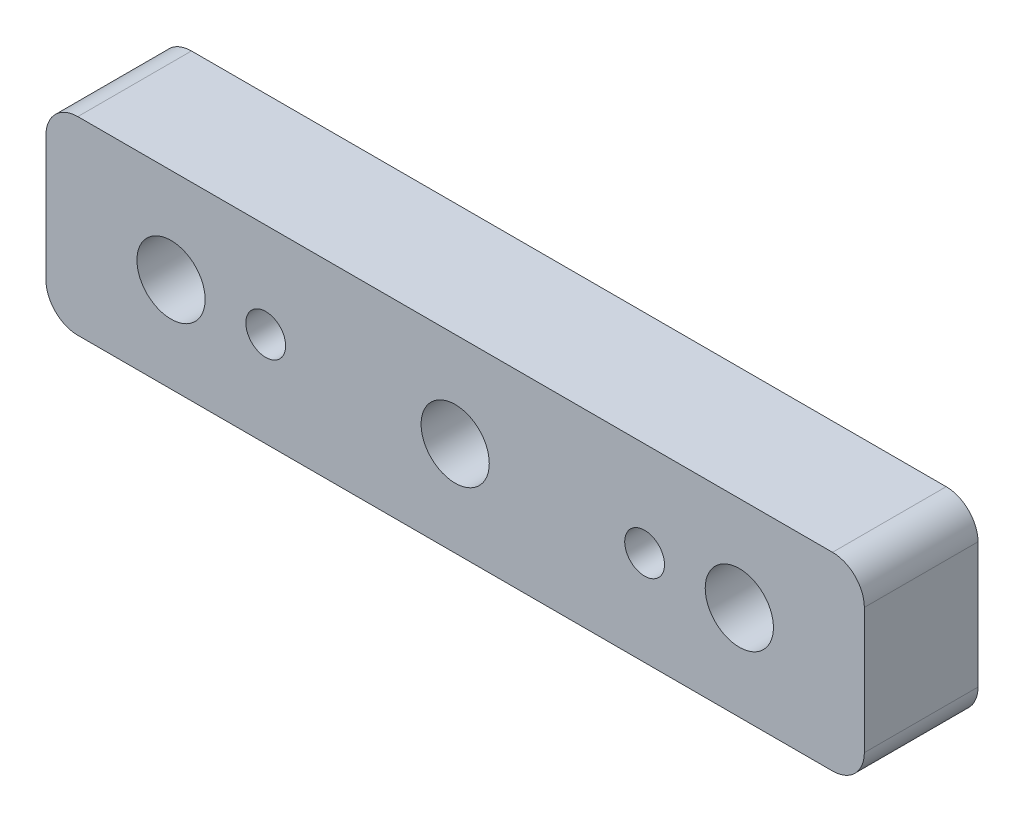
ISO-10303-21;
HEADER;
FILE_DESCRIPTION(('STEP AP214'),'2;1');
FILE_NAME('part.step','',(''),(''),'','','');
FILE_SCHEMA(('AUTOMOTIVE_DESIGN { 1 0 10303 214 1 1 1 1 }'));
ENDSEC;
DATA;
#1=APPLICATION_CONTEXT('core data for automotive mechanical design processes');
#2=APPLICATION_PROTOCOL_DEFINITION('international standard','automotive_design',2000,#1);
#3=PRODUCT_CONTEXT('',#1,'mechanical');
#4=PRODUCT('Part','Part','',(#3));
#5=PRODUCT_RELATED_PRODUCT_CATEGORY('part','',(#4));
#6=PRODUCT_DEFINITION_FORMATION('','',#4);
#7=PRODUCT_DEFINITION_CONTEXT('part definition',#1,'design');
#8=PRODUCT_DEFINITION('design','',#6,#7);
#9=PRODUCT_DEFINITION_SHAPE('','',#8);
#10=(LENGTH_UNIT() NAMED_UNIT(*) SI_UNIT(.MILLI.,.METRE.));
#11=(NAMED_UNIT(*) PLANE_ANGLE_UNIT() SI_UNIT($,.RADIAN.));
#12=(NAMED_UNIT(*) SI_UNIT($,.STERADIAN.) SOLID_ANGLE_UNIT());
#13=UNCERTAINTY_MEASURE_WITH_UNIT(LENGTH_MEASURE(1.E-05),#10,'distance_accuracy_value','');
#14=(GEOMETRIC_REPRESENTATION_CONTEXT(3) GLOBAL_UNCERTAINTY_ASSIGNED_CONTEXT((#13)) GLOBAL_UNIT_ASSIGNED_CONTEXT((#10,
#11,#12)) REPRESENTATION_CONTEXT('',''));
#15=CARTESIAN_POINT('',(0.,0.,0.));
#16=DIRECTION('',(0.,0.,1.));
#17=DIRECTION('',(1.,0.,0.));
#18=AXIS2_PLACEMENT_3D('',#15,#16,#17);
#19=CARTESIAN_POINT('',(39.84,6.64000000000001,12.));
#20=DIRECTION('',(0.,0.,-1.));
#21=DIRECTION('',(-1.,0.,0.));
#22=AXIS2_PLACEMENT_3D('',#19,#20,#21);
#23=CYLINDRICAL_SURFACE('',#22,3.36);
#24=CARTESIAN_POINT('',(39.84,6.64000000000001,0.));
#25=DIRECTION('',(0.,0.,1.));
#26=DIRECTION('',(1.,0.,0.));
#27=AXIS2_PLACEMENT_3D('',#24,#25,#26);
#28=CIRCLE('',#27,3.36);
#29=CARTESIAN_POINT('',(43.2,6.64000000000001,0.));
#30=VERTEX_POINT('',#29);
#31=CARTESIAN_POINT('',(39.84,10.,0.));
#32=VERTEX_POINT('',#31);
#33=EDGE_CURVE('E130',#30,#32,#28,.T.);
#34=ORIENTED_EDGE('',*,*,#33,.T.);
#35=DIRECTION('',(0.,0.,-1.));
#36=VECTOR('',#35,1.);
#37=CARTESIAN_POINT('',(39.84,10.,12.));
#38=LINE('',#37,#36);
#39=CARTESIAN_POINT('',(39.84,10.,12.));
#40=VERTEX_POINT('',#39);
#41=EDGE_CURVE('E11',#40,#32,#38,.T.);
#42=ORIENTED_EDGE('',*,*,#41,.F.);
#43=CARTESIAN_POINT('',(39.84,6.64000000000001,12.));
#44=DIRECTION('',(0.,0.,1.));
#45=DIRECTION('',(1.,0.,0.));
#46=AXIS2_PLACEMENT_3D('',#43,#44,#45);
#47=CIRCLE('',#46,3.36);
#48=CARTESIAN_POINT('',(43.2,6.64000000000001,12.));
#49=VERTEX_POINT('',#48);
#50=EDGE_CURVE('E145',#49,#40,#47,.T.);
#51=ORIENTED_EDGE('',*,*,#50,.F.);
#52=DIRECTION('',(0.,0.,-1.));
#53=VECTOR('',#52,1.);
#54=CARTESIAN_POINT('',(43.2,6.64000000000001,12.));
#55=LINE('',#54,#53);
#56=EDGE_CURVE('E126',#49,#30,#55,.T.);
#57=ORIENTED_EDGE('',*,*,#56,.T.);
#58=EDGE_LOOP('',(#34,#42,#51,#57));
#59=FACE_BOUND('',#58,.T.);
#60=ADVANCED_FACE('F34',(#59),#23,.T.);
#61=CARTESIAN_POINT('',(39.84,10.,12.));
#62=DIRECTION('',(0.,-1.,0.));
#63=DIRECTION('',(1.,0.,0.));
#64=AXIS2_PLACEMENT_3D('',#61,#62,#63);
#65=PLANE('',#64);
#66=DIRECTION('',(-1.,0.,0.));
#67=VECTOR('',#66,1.);
#68=CARTESIAN_POINT('',(39.84,10.,0.));
#69=LINE('',#68,#67);
#70=CARTESIAN_POINT('',(-39.84,9.99999999999999,0.));
#71=VERTEX_POINT('',#70);
#72=EDGE_CURVE('E133',#32,#71,#69,.T.);
#73=ORIENTED_EDGE('',*,*,#72,.T.);
#74=DIRECTION('',(0.,0.,-1.));
#75=VECTOR('',#74,1.);
#76=CARTESIAN_POINT('',(-39.84,9.99999999999999,12.));
#77=LINE('',#76,#75);
#78=CARTESIAN_POINT('',(-39.84,9.99999999999999,12.));
#79=VERTEX_POINT('',#78);
#80=EDGE_CURVE('E42',#79,#71,#77,.T.);
#81=ORIENTED_EDGE('',*,*,#80,.F.);
#82=DIRECTION('',(-1.,0.,0.));
#83=VECTOR('',#82,1.);
#84=CARTESIAN_POINT('',(39.84,10.,12.));
#85=LINE('',#84,#83);
#86=EDGE_CURVE('E93',#40,#79,#85,.T.);
#87=ORIENTED_EDGE('',*,*,#86,.F.);
#88=ORIENTED_EDGE('',*,*,#41,.T.);
#89=EDGE_LOOP('',(#73,#81,#87,#88));
#90=FACE_BOUND('',#89,.T.);
#91=ADVANCED_FACE('F238',(#90),#65,.F.);
#92=CARTESIAN_POINT('',(-39.84,6.64,12.));
#93=DIRECTION('',(0.,0.,-1.));
#94=DIRECTION('',(-1.,0.,0.));
#95=AXIS2_PLACEMENT_3D('',#92,#93,#94);
#96=CYLINDRICAL_SURFACE('',#95,3.36);
#97=CARTESIAN_POINT('',(-39.84,6.64,0.));
#98=DIRECTION('',(0.,0.,1.));
#99=DIRECTION('',(1.,0.,0.));
#100=AXIS2_PLACEMENT_3D('',#97,#98,#99);
#101=CIRCLE('',#100,3.36);
#102=CARTESIAN_POINT('',(-43.2,6.64,0.));
#103=VERTEX_POINT('',#102);
#104=EDGE_CURVE('E136',#71,#103,#101,.T.);
#105=ORIENTED_EDGE('',*,*,#104,.T.);
#106=DIRECTION('',(0.,0.,-1.));
#107=VECTOR('',#106,1.);
#108=CARTESIAN_POINT('',(-43.2,6.64,12.));
#109=LINE('',#108,#107);
#110=CARTESIAN_POINT('',(-43.2,6.64,12.));
#111=VERTEX_POINT('',#110);
#112=EDGE_CURVE('E152',#111,#103,#109,.T.);
#113=ORIENTED_EDGE('',*,*,#112,.F.);
#114=CARTESIAN_POINT('',(-39.84,6.64,12.));
#115=DIRECTION('',(0.,0.,1.));
#116=DIRECTION('',(1.,0.,0.));
#117=AXIS2_PLACEMENT_3D('',#114,#115,#116);
#118=CIRCLE('',#117,3.36);
#119=EDGE_CURVE('E160',#79,#111,#118,.T.);
#120=ORIENTED_EDGE('',*,*,#119,.F.);
#121=ORIENTED_EDGE('',*,*,#80,.T.);
#122=EDGE_LOOP('',(#105,#113,#120,#121));
#123=FACE_BOUND('',#122,.T.);
#124=ADVANCED_FACE('F158',(#123),#96,.T.);
#125=CARTESIAN_POINT('',(-43.2,-6.64,12.));
#126=DIRECTION('',(1.,0.,0.));
#127=DIRECTION('',(0.,0.,-1.));
#128=AXIS2_PLACEMENT_3D('',#125,#126,#127);
#129=PLANE('',#128);
#130=DIRECTION('',(0.,-1.,0.));
#131=VECTOR('',#130,1.);
#132=CARTESIAN_POINT('',(-43.2,-6.64,0.));
#133=LINE('',#132,#131);
#134=CARTESIAN_POINT('',(-43.2,-6.64,0.));
#135=VERTEX_POINT('',#134);
#136=EDGE_CURVE('E138',#103,#135,#133,.T.);
#137=ORIENTED_EDGE('',*,*,#136,.T.);
#138=DIRECTION('',(0.,0.,-1.));
#139=VECTOR('',#138,1.);
#140=CARTESIAN_POINT('',(-43.2,-6.64,12.));
#141=LINE('',#140,#139);
#142=CARTESIAN_POINT('',(-43.2,-6.64,12.));
#143=VERTEX_POINT('',#142);
#144=EDGE_CURVE('E149',#143,#135,#141,.T.);
#145=ORIENTED_EDGE('',*,*,#144,.F.);
#146=DIRECTION('',(0.,-1.,0.));
#147=VECTOR('',#146,1.);
#148=CARTESIAN_POINT('',(-43.2,-6.64,12.));
#149=LINE('',#148,#147);
#150=EDGE_CURVE('E172',#111,#143,#149,.T.);
#151=ORIENTED_EDGE('',*,*,#150,.F.);
#152=ORIENTED_EDGE('',*,*,#112,.T.);
#153=EDGE_LOOP('',(#137,#145,#151,#152));
#154=FACE_BOUND('',#153,.T.);
#155=ADVANCED_FACE('F168',(#154),#129,.F.);
#156=CARTESIAN_POINT('',(-39.84,-6.64,12.));
#157=DIRECTION('',(0.,0.,-1.));
#158=DIRECTION('',(-1.,0.,0.));
#159=AXIS2_PLACEMENT_3D('',#156,#157,#158);
#160=CYLINDRICAL_SURFACE('',#159,3.36);
#161=CARTESIAN_POINT('',(-39.84,-6.64,0.));
#162=DIRECTION('',(0.,0.,1.));
#163=DIRECTION('',(-1.,0.,0.));
#164=AXIS2_PLACEMENT_3D('',#161,#162,#163);
#165=CIRCLE('',#164,3.36);
#166=CARTESIAN_POINT('',(-39.84,-10.,0.));
#167=VERTEX_POINT('',#166);
#168=EDGE_CURVE('E140',#135,#167,#165,.T.);
#169=ORIENTED_EDGE('',*,*,#168,.T.);
#170=DIRECTION('',(0.,0.,-1.));
#171=VECTOR('',#170,1.);
#172=CARTESIAN_POINT('',(-39.84,-10.,12.));
#173=LINE('',#172,#171);
#174=CARTESIAN_POINT('',(-39.84,-10.,12.));
#175=VERTEX_POINT('',#174);
#176=EDGE_CURVE('E121',#175,#167,#173,.T.);
#177=ORIENTED_EDGE('',*,*,#176,.F.);
#178=CARTESIAN_POINT('',(-39.84,-6.64,12.));
#179=DIRECTION('',(0.,0.,1.));
#180=DIRECTION('',(-1.,0.,0.));
#181=AXIS2_PLACEMENT_3D('',#178,#179,#180);
#182=CIRCLE('',#181,3.36);
#183=EDGE_CURVE('E112',#143,#175,#182,.T.);
#184=ORIENTED_EDGE('',*,*,#183,.F.);
#185=ORIENTED_EDGE('',*,*,#144,.T.);
#186=EDGE_LOOP('',(#169,#177,#184,#185));
#187=FACE_BOUND('',#186,.T.);
#188=ADVANCED_FACE('F171',(#187),#160,.T.);
#189=CARTESIAN_POINT('',(39.84,-9.99999999999999,12.));
#190=DIRECTION('',(0.,1.,0.));
#191=DIRECTION('',(-1.,0.,0.));
#192=AXIS2_PLACEMENT_3D('',#189,#190,#191);
#193=PLANE('',#192);
#194=DIRECTION('',(1.,0.,0.));
#195=VECTOR('',#194,1.);
#196=CARTESIAN_POINT('',(39.84,-9.99999999999999,0.));
#197=LINE('',#196,#195);
#198=CARTESIAN_POINT('',(39.84,-9.99999999999999,0.));
#199=VERTEX_POINT('',#198);
#200=EDGE_CURVE('E120',#167,#199,#197,.T.);
#201=ORIENTED_EDGE('',*,*,#200,.T.);
#202=DIRECTION('',(0.,0.,-1.));
#203=VECTOR('',#202,1.);
#204=CARTESIAN_POINT('',(39.84,-9.99999999999999,12.));
#205=LINE('',#204,#203);
#206=CARTESIAN_POINT('',(39.84,-9.99999999999999,12.));
#207=VERTEX_POINT('',#206);
#208=EDGE_CURVE('E117',#207,#199,#205,.T.);
#209=ORIENTED_EDGE('',*,*,#208,.F.);
#210=DIRECTION('',(1.,0.,0.));
#211=VECTOR('',#210,1.);
#212=CARTESIAN_POINT('',(39.84,-9.99999999999999,12.));
#213=LINE('',#212,#211);
#214=EDGE_CURVE('E106',#175,#207,#213,.T.);
#215=ORIENTED_EDGE('',*,*,#214,.F.);
#216=ORIENTED_EDGE('',*,*,#176,.T.);
#217=EDGE_LOOP('',(#201,#209,#215,#216));
#218=FACE_BOUND('',#217,.T.);
#219=ADVANCED_FACE('F118',(#218),#193,.F.);
#220=CARTESIAN_POINT('',(39.84,-6.64,12.));
#221=DIRECTION('',(0.,0.,-1.));
#222=DIRECTION('',(-1.,0.,0.));
#223=AXIS2_PLACEMENT_3D('',#220,#221,#222);
#224=CYLINDRICAL_SURFACE('',#223,3.36);
#225=CARTESIAN_POINT('',(39.84,-6.64,0.));
#226=DIRECTION('',(0.,0.,1.));
#227=DIRECTION('',(1.,0.,0.));
#228=AXIS2_PLACEMENT_3D('',#225,#226,#227);
#229=CIRCLE('',#228,3.36);
#230=CARTESIAN_POINT('',(43.2,-6.64,0.));
#231=VERTEX_POINT('',#230);
#232=EDGE_CURVE('E79',#199,#231,#229,.T.);
#233=ORIENTED_EDGE('',*,*,#232,.T.);
#234=DIRECTION('',(0.,0.,-1.));
#235=VECTOR('',#234,1.);
#236=CARTESIAN_POINT('',(43.2,-6.64,12.));
#237=LINE('',#236,#235);
#238=CARTESIAN_POINT('',(43.2,-6.64,12.));
#239=VERTEX_POINT('',#238);
#240=EDGE_CURVE('E122',#239,#231,#237,.T.);
#241=ORIENTED_EDGE('',*,*,#240,.F.);
#242=CARTESIAN_POINT('',(39.84,-6.64,12.));
#243=DIRECTION('',(0.,0.,1.));
#244=DIRECTION('',(1.,0.,0.));
#245=AXIS2_PLACEMENT_3D('',#242,#243,#244);
#246=CIRCLE('',#245,3.36);
#247=EDGE_CURVE('E110',#207,#239,#246,.T.);
#248=ORIENTED_EDGE('',*,*,#247,.F.);
#249=ORIENTED_EDGE('',*,*,#208,.T.);
#250=EDGE_LOOP('',(#233,#241,#248,#249));
#251=FACE_BOUND('',#250,.T.);
#252=ADVANCED_FACE('F124',(#251),#224,.T.);
#253=CARTESIAN_POINT('',(43.2,-6.64,12.));
#254=DIRECTION('',(-1.,0.,0.));
#255=DIRECTION('',(0.,0.,1.));
#256=AXIS2_PLACEMENT_3D('',#253,#254,#255);
#257=PLANE('',#256);
#258=DIRECTION('',(0.,1.,0.));
#259=VECTOR('',#258,1.);
#260=CARTESIAN_POINT('',(43.2,-6.64,0.));
#261=LINE('',#260,#259);
#262=EDGE_CURVE('E85',#231,#30,#261,.T.);
#263=ORIENTED_EDGE('',*,*,#262,.T.);
#264=ORIENTED_EDGE('',*,*,#56,.F.);
#265=DIRECTION('',(0.,1.,0.));
#266=VECTOR('',#265,1.);
#267=CARTESIAN_POINT('',(43.2,-6.64,12.));
#268=LINE('',#267,#266);
#269=EDGE_CURVE('E50',#239,#49,#268,.T.);
#270=ORIENTED_EDGE('',*,*,#269,.F.);
#271=ORIENTED_EDGE('',*,*,#240,.T.);
#272=EDGE_LOOP('',(#263,#264,#270,#271));
#273=FACE_BOUND('',#272,.T.);
#274=ADVANCED_FACE('F212',(#273),#257,.F.);
#275=CARTESIAN_POINT('',(39.84,6.64000000000001,12.));
#276=DIRECTION('',(0.,0.,1.));
#277=DIRECTION('',(1.,0.,0.));
#278=AXIS2_PLACEMENT_3D('',#275,#276,#277);
#279=PLANE('',#278);
#280=CARTESIAN_POINT('',(-20.,0.,12.));
#281=DIRECTION('',(0.,0.,1.));
#282=DIRECTION('',(1.,0.,0.));
#283=AXIS2_PLACEMENT_3D('',#280,#281,#282);
#284=CIRCLE('',#283,2.09999999999999);
#285=CARTESIAN_POINT('',(-17.9,0.,12.));
#286=VERTEX_POINT('',#285);
#287=EDGE_CURVE('E204',#286,#286,#284,.T.);
#288=ORIENTED_EDGE('',*,*,#287,.F.);
#289=EDGE_LOOP('',(#288));
#290=FACE_BOUND('',#289,.T.);
#291=CARTESIAN_POINT('',(20.,0.,12.));
#292=DIRECTION('',(0.,0.,1.));
#293=DIRECTION('',(1.,0.,0.));
#294=AXIS2_PLACEMENT_3D('',#291,#292,#293);
#295=CIRCLE('',#294,2.09999999999999);
#296=CARTESIAN_POINT('',(22.1,0.,12.));
#297=VERTEX_POINT('',#296);
#298=EDGE_CURVE('E198',#297,#297,#295,.T.);
#299=ORIENTED_EDGE('',*,*,#298,.F.);
#300=EDGE_LOOP('',(#299));
#301=FACE_BOUND('',#300,.T.);
#302=CARTESIAN_POINT('',(30.,0.,12.));
#303=DIRECTION('',(0.,0.,1.));
#304=DIRECTION('',(-1.,0.,0.));
#305=AXIS2_PLACEMENT_3D('',#302,#303,#304);
#306=CIRCLE('',#305,3.6);
#307=CARTESIAN_POINT('',(26.4,0.,12.));
#308=VERTEX_POINT('',#307);
#309=EDGE_CURVE('E190',#308,#308,#306,.T.);
#310=ORIENTED_EDGE('',*,*,#309,.F.);
#311=EDGE_LOOP('',(#310));
#312=FACE_BOUND('',#311,.T.);
#313=CARTESIAN_POINT('',(-30.,0.,12.));
#314=DIRECTION('',(0.,0.,1.));
#315=DIRECTION('',(1.,0.,0.));
#316=AXIS2_PLACEMENT_3D('',#313,#314,#315);
#317=CIRCLE('',#316,3.6);
#318=CARTESIAN_POINT('',(-26.4,0.,12.));
#319=VERTEX_POINT('',#318);
#320=EDGE_CURVE('E184',#319,#319,#317,.T.);
#321=ORIENTED_EDGE('',*,*,#320,.F.);
#322=EDGE_LOOP('',(#321));
#323=FACE_BOUND('',#322,.T.);
#324=CARTESIAN_POINT('',(0.,0.,12.));
#325=DIRECTION('',(0.,0.,1.));
#326=DIRECTION('',(1.,0.,0.));
#327=AXIS2_PLACEMENT_3D('',#324,#325,#326);
#328=CIRCLE('',#327,3.6);
#329=CARTESIAN_POINT('',(3.6,0.,12.));
#330=VERTEX_POINT('',#329);
#331=EDGE_CURVE('E178',#330,#330,#328,.T.);
#332=ORIENTED_EDGE('',*,*,#331,.F.);
#333=EDGE_LOOP('',(#332));
#334=FACE_BOUND('',#333,.T.);
#335=ORIENTED_EDGE('',*,*,#50,.T.);
#336=ORIENTED_EDGE('',*,*,#86,.T.);
#337=ORIENTED_EDGE('',*,*,#119,.T.);
#338=ORIENTED_EDGE('',*,*,#150,.T.);
#339=ORIENTED_EDGE('',*,*,#183,.T.);
#340=ORIENTED_EDGE('',*,*,#214,.T.);
#341=ORIENTED_EDGE('',*,*,#247,.T.);
#342=ORIENTED_EDGE('',*,*,#269,.T.);
#343=EDGE_LOOP('',(#335,#336,#337,#338,#339,#340,#341,#342));
#344=FACE_BOUND('',#343,.T.);
#345=ADVANCED_FACE('F108',(#290,#301,#312,#323,#334,#344),#279,.T.);
#346=CARTESIAN_POINT('',(39.84,6.64000000000001,0.));
#347=DIRECTION('',(0.,0.,1.));
#348=DIRECTION('',(1.,0.,0.));
#349=AXIS2_PLACEMENT_3D('',#346,#347,#348);
#350=PLANE('',#349);
#351=CARTESIAN_POINT('',(-20.,0.,0.));
#352=DIRECTION('',(0.,0.,1.));
#353=DIRECTION('',(1.,0.,0.));
#354=AXIS2_PLACEMENT_3D('',#351,#352,#353);
#355=CIRCLE('',#354,2.1);
#356=CARTESIAN_POINT('',(-17.9,0.,0.));
#357=VERTEX_POINT('',#356);
#358=EDGE_CURVE('E201',#357,#357,#355,.T.);
#359=ORIENTED_EDGE('',*,*,#358,.T.);
#360=EDGE_LOOP('',(#359));
#361=FACE_BOUND('',#360,.T.);
#362=CARTESIAN_POINT('',(20.,0.,0.));
#363=DIRECTION('',(0.,0.,1.));
#364=DIRECTION('',(1.,0.,0.));
#365=AXIS2_PLACEMENT_3D('',#362,#363,#364);
#366=CIRCLE('',#365,2.1);
#367=CARTESIAN_POINT('',(22.1,0.,0.));
#368=VERTEX_POINT('',#367);
#369=EDGE_CURVE('E193',#368,#368,#366,.T.);
#370=ORIENTED_EDGE('',*,*,#369,.T.);
#371=EDGE_LOOP('',(#370));
#372=FACE_BOUND('',#371,.T.);
#373=CARTESIAN_POINT('',(30.,0.,0.));
#374=DIRECTION('',(0.,0.,1.));
#375=DIRECTION('',(-1.,0.,0.));
#376=AXIS2_PLACEMENT_3D('',#373,#374,#375);
#377=CIRCLE('',#376,3.6);
#378=CARTESIAN_POINT('',(26.4,0.,0.));
#379=VERTEX_POINT('',#378);
#380=EDGE_CURVE('E187',#379,#379,#377,.T.);
#381=ORIENTED_EDGE('',*,*,#380,.T.);
#382=EDGE_LOOP('',(#381));
#383=FACE_BOUND('',#382,.T.);
#384=CARTESIAN_POINT('',(-30.,0.,0.));
#385=DIRECTION('',(0.,0.,1.));
#386=DIRECTION('',(1.,0.,0.));
#387=AXIS2_PLACEMENT_3D('',#384,#385,#386);
#388=CIRCLE('',#387,3.6);
#389=CARTESIAN_POINT('',(-26.4,0.,0.));
#390=VERTEX_POINT('',#389);
#391=EDGE_CURVE('E181',#390,#390,#388,.T.);
#392=ORIENTED_EDGE('',*,*,#391,.T.);
#393=EDGE_LOOP('',(#392));
#394=FACE_BOUND('',#393,.T.);
#395=CARTESIAN_POINT('',(0.,0.,0.));
#396=DIRECTION('',(0.,0.,1.));
#397=DIRECTION('',(1.,0.,0.));
#398=AXIS2_PLACEMENT_3D('',#395,#396,#397);
#399=CIRCLE('',#398,3.6);
#400=CARTESIAN_POINT('',(3.6,0.,0.));
#401=VERTEX_POINT('',#400);
#402=EDGE_CURVE('E134',#401,#401,#399,.T.);
#403=ORIENTED_EDGE('',*,*,#402,.T.);
#404=EDGE_LOOP('',(#403));
#405=FACE_BOUND('',#404,.T.);
#406=ORIENTED_EDGE('',*,*,#33,.F.);
#407=ORIENTED_EDGE('',*,*,#262,.F.);
#408=ORIENTED_EDGE('',*,*,#232,.F.);
#409=ORIENTED_EDGE('',*,*,#200,.F.);
#410=ORIENTED_EDGE('',*,*,#168,.F.);
#411=ORIENTED_EDGE('',*,*,#136,.F.);
#412=ORIENTED_EDGE('',*,*,#104,.F.);
#413=ORIENTED_EDGE('',*,*,#72,.F.);
#414=EDGE_LOOP('',(#406,#407,#408,#409,#410,#411,#412,#413));
#415=FACE_BOUND('',#414,.T.);
#416=ADVANCED_FACE('F164',(#361,#372,#383,#394,#405,#415),#350,.F.);
#417=CARTESIAN_POINT('',(0.,0.,0.));
#418=DIRECTION('',(0.,0.,1.));
#419=DIRECTION('',(1.,0.,0.));
#420=AXIS2_PLACEMENT_3D('',#417,#418,#419);
#421=CYLINDRICAL_SURFACE('',#420,3.6);
#422=ORIENTED_EDGE('',*,*,#402,.F.);
#423=EDGE_LOOP('',(#422));
#424=FACE_BOUND('',#423,.T.);
#425=ORIENTED_EDGE('',*,*,#331,.T.);
#426=EDGE_LOOP('',(#425));
#427=FACE_BOUND('',#426,.T.);
#428=ADVANCED_FACE('F222',(#424,#427),#421,.F.);
#429=CARTESIAN_POINT('',(-30.,0.,0.));
#430=DIRECTION('',(0.,0.,1.));
#431=DIRECTION('',(1.,0.,0.));
#432=AXIS2_PLACEMENT_3D('',#429,#430,#431);
#433=CYLINDRICAL_SURFACE('',#432,3.6);
#434=ORIENTED_EDGE('',*,*,#391,.F.);
#435=EDGE_LOOP('',(#434));
#436=FACE_BOUND('',#435,.T.);
#437=ORIENTED_EDGE('',*,*,#320,.T.);
#438=EDGE_LOOP('',(#437));
#439=FACE_BOUND('',#438,.T.);
#440=ADVANCED_FACE('F224',(#436,#439),#433,.F.);
#441=CARTESIAN_POINT('',(30.,0.,0.));
#442=DIRECTION('',(0.,0.,1.));
#443=DIRECTION('',(1.,0.,0.));
#444=AXIS2_PLACEMENT_3D('',#441,#442,#443);
#445=CYLINDRICAL_SURFACE('',#444,3.6);
#446=ORIENTED_EDGE('',*,*,#380,.F.);
#447=EDGE_LOOP('',(#446));
#448=FACE_BOUND('',#447,.T.);
#449=ORIENTED_EDGE('',*,*,#309,.T.);
#450=EDGE_LOOP('',(#449));
#451=FACE_BOUND('',#450,.T.);
#452=ADVANCED_FACE('F231',(#448,#451),#445,.F.);
#453=CARTESIAN_POINT('',(20.,0.,12.));
#454=DIRECTION('',(0.,0.,1.));
#455=DIRECTION('',(1.,0.,0.));
#456=AXIS2_PLACEMENT_3D('',#453,#454,#455);
#457=CYLINDRICAL_SURFACE('',#456,2.09999999999999);
#458=ORIENTED_EDGE('',*,*,#369,.F.);
#459=EDGE_LOOP('',(#458));
#460=FACE_BOUND('',#459,.T.);
#461=ORIENTED_EDGE('',*,*,#298,.T.);
#462=EDGE_LOOP('',(#461));
#463=FACE_BOUND('',#462,.T.);
#464=ADVANCED_FACE('F304',(#460,#463),#457,.F.);
#465=CARTESIAN_POINT('',(-20.,0.,12.));
#466=DIRECTION('',(0.,0.,1.));
#467=DIRECTION('',(1.,0.,0.));
#468=AXIS2_PLACEMENT_3D('',#465,#466,#467);
#469=CYLINDRICAL_SURFACE('',#468,2.09999999999999);
#470=ORIENTED_EDGE('',*,*,#358,.F.);
#471=EDGE_LOOP('',(#470));
#472=FACE_BOUND('',#471,.T.);
#473=ORIENTED_EDGE('',*,*,#287,.T.);
#474=EDGE_LOOP('',(#473));
#475=FACE_BOUND('',#474,.T.);
#476=ADVANCED_FACE('F208',(#472,#475),#469,.F.);
#477=CLOSED_SHELL('',(#60,#91,#124,#155,#188,#219,#252,#274,#345,#416,#428,#440,#452,#464,#476));
#478=MANIFOLD_SOLID_BREP('B2',#477);
#479=ADVANCED_BREP_SHAPE_REPRESENTATION('',(#18,#478),#14);
#480=SHAPE_DEFINITION_REPRESENTATION(#9,#479);
ENDSEC;
END-ISO-10303-21;
